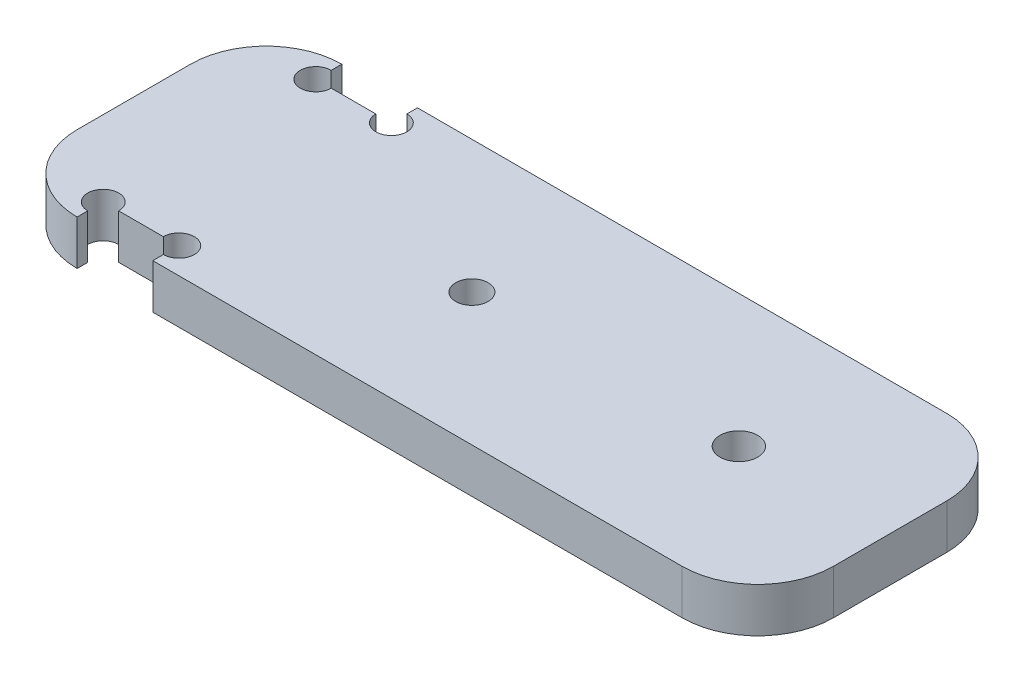
ISO-10303-21;
HEADER;
FILE_DESCRIPTION(('STEP AP214'),'2;1');
FILE_NAME('part.step','',(''),(''),'','','');
FILE_SCHEMA(('AUTOMOTIVE_DESIGN { 1 0 10303 214 1 1 1 1 }'));
ENDSEC;
DATA;
#1=APPLICATION_CONTEXT('core data for automotive mechanical design processes');
#2=APPLICATION_PROTOCOL_DEFINITION('international standard','automotive_design',2000,#1);
#3=PRODUCT_CONTEXT('',#1,'mechanical');
#4=PRODUCT('Part','Part','',(#3));
#5=PRODUCT_RELATED_PRODUCT_CATEGORY('part','',(#4));
#6=PRODUCT_DEFINITION_FORMATION('','',#4);
#7=PRODUCT_DEFINITION_CONTEXT('part definition',#1,'design');
#8=PRODUCT_DEFINITION('design','',#6,#7);
#9=PRODUCT_DEFINITION_SHAPE('','',#8);
#10=(LENGTH_UNIT() NAMED_UNIT(*) SI_UNIT(.MILLI.,.METRE.));
#11=(NAMED_UNIT(*) PLANE_ANGLE_UNIT() SI_UNIT($,.RADIAN.));
#12=(NAMED_UNIT(*) SI_UNIT($,.STERADIAN.) SOLID_ANGLE_UNIT());
#13=UNCERTAINTY_MEASURE_WITH_UNIT(LENGTH_MEASURE(1.E-05),#10,'distance_accuracy_value','');
#14=(GEOMETRIC_REPRESENTATION_CONTEXT(3) GLOBAL_UNCERTAINTY_ASSIGNED_CONTEXT((#13)) GLOBAL_UNIT_ASSIGNED_CONTEXT((#10,
#11,#12)) REPRESENTATION_CONTEXT('',''));
#15=CARTESIAN_POINT('',(0.,0.,0.));
#16=DIRECTION('',(0.,0.,1.));
#17=DIRECTION('',(1.,0.,0.));
#18=AXIS2_PLACEMENT_3D('',#15,#16,#17);
#19=CARTESIAN_POINT('',(49.9999999999985,5.89999999999947,17.4999999999993));
#20=DIRECTION('',(-0.999999999999989,0.,0.));
#21=DIRECTION('',(0.,0.,0.999999999999989));
#22=AXIS2_PLACEMENT_3D('',#19,#20,#21);
#23=PLANE('',#22);
#24=DIRECTION('',(0.,0.,-0.999999999999989));
#25=VECTOR('',#24,1.);
#26=CARTESIAN_POINT('',(49.999999999999,-1.2490009027033E-13,17.4999999999993));
#27=LINE('',#26,#25);
#28=CARTESIAN_POINT('',(49.9999999999995,0.,7.49999999999998));
#29=VERTEX_POINT('',#28);
#30=CARTESIAN_POINT('',(49.9999999999988,-1.2490009027033E-13,-7.50000000000019));
#31=VERTEX_POINT('',#30);
#32=EDGE_CURVE('E230',#29,#31,#27,.T.);
#33=ORIENTED_EDGE('',*,*,#32,.T.);
#34=DIRECTION('',(0.,-0.999999999999966,0.));
#35=VECTOR('',#34,1.);
#36=CARTESIAN_POINT('',(49.9999999999986,5.89999999999947,-7.50000000000055));
#37=LINE('',#36,#35);
#38=CARTESIAN_POINT('',(49.9999999999986,5.89999999999947,-7.50000000000055));
#39=VERTEX_POINT('',#38);
#40=EDGE_CURVE('E272',#31,#39,#37,.F.);
#41=ORIENTED_EDGE('',*,*,#40,.T.);
#42=DIRECTION('',(0.,0.,-0.999999999999989));
#43=VECTOR('',#42,1.);
#44=CARTESIAN_POINT('',(49.9999999999985,5.89999999999947,17.4999999999993));
#45=LINE('',#44,#43);
#46=CARTESIAN_POINT('',(49.9999999999988,5.89999999999947,7.50000000000006));
#47=VERTEX_POINT('',#46);
#48=EDGE_CURVE('E218',#47,#39,#45,.T.);
#49=ORIENTED_EDGE('',*,*,#48,.F.);
#50=DIRECTION('',(0.,-0.999999999999966,0.));
#51=VECTOR('',#50,1.);
#52=CARTESIAN_POINT('',(49.9999999999988,5.89999999999947,7.50000000000006));
#53=LINE('',#52,#51);
#54=EDGE_CURVE('E269',#47,#29,#53,.T.);
#55=ORIENTED_EDGE('',*,*,#54,.T.);
#56=EDGE_LOOP('',(#33,#41,#49,#55));
#57=FACE_BOUND('',#56,.T.);
#58=ADVANCED_FACE('F39',(#57),#23,.F.);
#59=CARTESIAN_POINT('',(-49.9999999999997,5.89999999999947,-17.5000000000021));
#60=DIRECTION('',(0.,0.,0.999999999999989));
#61=DIRECTION('',(0.999999999999989,0.,0.));
#62=AXIS2_PLACEMENT_3D('',#59,#60,#61);
#63=PLANE('',#62);
#64=DIRECTION('',(-0.999999999999989,0.,0.));
#65=VECTOR('',#64,1.);
#66=CARTESIAN_POINT('',(-50.,-1.06858966120171E-12,-17.5000000000021));
#67=LINE('',#66,#65);
#68=CARTESIAN_POINT('',(39.9999999999986,0.,-17.5000000000015));
#69=VERTEX_POINT('',#68);
#70=CARTESIAN_POINT('',(-30.,0.,-17.5));
#71=VERTEX_POINT('',#70);
#72=EDGE_CURVE('E233',#69,#71,#67,.T.);
#73=ORIENTED_EDGE('',*,*,#72,.T.);
#74=DIRECTION('',(0.,0.999999999999966,0.));
#75=VECTOR('',#74,1.);
#76=CARTESIAN_POINT('',(-30.,-4.10000000000001,-17.4999999999999));
#77=LINE('',#76,#75);
#78=CARTESIAN_POINT('',(-29.999999999999,5.89999999999947,-17.5000000000008));
#79=VERTEX_POINT('',#78);
#80=EDGE_CURVE('E187',#71,#79,#77,.T.);
#81=ORIENTED_EDGE('',*,*,#80,.T.);
#82=DIRECTION('',(-0.999999999999989,0.,0.));
#83=VECTOR('',#82,1.);
#84=CARTESIAN_POINT('',(-49.9999999999997,5.89999999999947,-17.5000000000021));
#85=LINE('',#84,#83);
#86=CARTESIAN_POINT('',(39.9999999999985,5.89999999999947,-17.5000000000014));
#87=VERTEX_POINT('',#86);
#88=EDGE_CURVE('E221',#87,#79,#85,.T.);
#89=ORIENTED_EDGE('',*,*,#88,.F.);
#90=DIRECTION('',(0.,-0.999999999999966,0.));
#91=VECTOR('',#90,1.);
#92=CARTESIAN_POINT('',(39.9999999999985,5.89999999999947,-17.5000000000014));
#93=LINE('',#92,#91);
#94=EDGE_CURVE('E255',#87,#69,#93,.T.);
#95=ORIENTED_EDGE('',*,*,#94,.T.);
#96=EDGE_LOOP('',(#73,#81,#89,#95));
#97=FACE_BOUND('',#96,.T.);
#98=ADVANCED_FACE('F375',(#97),#63,.F.);
#99=CARTESIAN_POINT('',(-49.9999999999989,5.89999999999947,17.5));
#100=DIRECTION('',(0.999999999999989,0.,0.));
#101=DIRECTION('',(0.,0.,-0.999999999999989));
#102=AXIS2_PLACEMENT_3D('',#99,#100,#101);
#103=PLANE('',#102);
#104=DIRECTION('',(0.,0.,0.999999999999989));
#105=VECTOR('',#104,1.);
#106=CARTESIAN_POINT('',(-49.9999999999989,5.89999999999947,17.5));
#107=LINE('',#106,#105);
#108=CARTESIAN_POINT('',(-49.9999999999999,5.89999999999893,-7.49999999999991));
#109=VERTEX_POINT('',#108);
#110=CARTESIAN_POINT('',(-49.9999999999989,5.89999999999947,7.49999999999967));
#111=VERTEX_POINT('',#110);
#112=EDGE_CURVE('E224',#109,#111,#107,.T.);
#113=ORIENTED_EDGE('',*,*,#112,.F.);
#114=DIRECTION('',(0.,-0.999999999999966,0.));
#115=VECTOR('',#114,1.);
#116=CARTESIAN_POINT('',(-49.9999999999999,5.89999999999893,-7.49999999999991));
#117=LINE('',#116,#115);
#118=CARTESIAN_POINT('',(-49.9999999999999,-1.06858966120171E-12,-7.49999999999977));
#119=VERTEX_POINT('',#118);
#120=EDGE_CURVE('E242',#109,#119,#117,.T.);
#121=ORIENTED_EDGE('',*,*,#120,.T.);
#122=DIRECTION('',(0.,0.,0.999999999999989));
#123=VECTOR('',#122,1.);
#124=CARTESIAN_POINT('',(-50.,-1.06858966120171E-12,17.5));
#125=LINE('',#124,#123);
#126=CARTESIAN_POINT('',(-50.,0.,7.50000000000001));
#127=VERTEX_POINT('',#126);
#128=EDGE_CURVE('E235',#119,#127,#125,.T.);
#129=ORIENTED_EDGE('',*,*,#128,.T.);
#130=DIRECTION('',(0.,-0.999999999999966,0.));
#131=VECTOR('',#130,1.);
#132=CARTESIAN_POINT('',(-49.9999999999989,5.89999999999947,7.49999999999967));
#133=LINE('',#132,#131);
#134=EDGE_CURVE('E229',#127,#111,#133,.F.);
#135=ORIENTED_EDGE('',*,*,#134,.T.);
#136=EDGE_LOOP('',(#113,#121,#129,#135));
#137=FACE_BOUND('',#136,.T.);
#138=ADVANCED_FACE('F335',(#137),#103,.F.);
#139=CARTESIAN_POINT('',(-49.9999999999989,5.89999999999947,17.5));
#140=DIRECTION('',(0.,0.,-0.999999999999989));
#141=DIRECTION('',(-0.999999999999989,0.,0.));
#142=AXIS2_PLACEMENT_3D('',#139,#140,#141);
#143=PLANE('',#142);
#144=DIRECTION('',(0.999999999999989,0.,0.));
#145=VECTOR('',#144,1.);
#146=CARTESIAN_POINT('',(-49.9999999999989,5.89999999999947,17.5));
#147=LINE('',#146,#145);
#148=CARTESIAN_POINT('',(-29.9999999999989,5.89999999999945,17.4999999999996));
#149=VERTEX_POINT('',#148);
#150=CARTESIAN_POINT('',(39.9999999999986,5.89999999999947,17.4999999999991));
#151=VERTEX_POINT('',#150);
#152=EDGE_CURVE('E227',#149,#151,#147,.T.);
#153=ORIENTED_EDGE('',*,*,#152,.F.);
#154=DIRECTION('',(0.,0.999999999999966,0.));
#155=VECTOR('',#154,1.);
#156=CARTESIAN_POINT('',(-30.,-4.10000000000001,17.5));
#157=LINE('',#156,#155);
#158=CARTESIAN_POINT('',(-30.,-1.06858966120171E-12,17.5));
#159=VERTEX_POINT('',#158);
#160=EDGE_CURVE('E201',#159,#149,#157,.T.);
#161=ORIENTED_EDGE('',*,*,#160,.F.);
#162=DIRECTION('',(0.999999999999989,0.,0.));
#163=VECTOR('',#162,1.);
#164=CARTESIAN_POINT('',(-50.,-1.06858966120171E-12,17.5));
#165=LINE('',#164,#163);
#166=CARTESIAN_POINT('',(39.999999999999,0.,17.4999999999989));
#167=VERTEX_POINT('',#166);
#168=EDGE_CURVE('E222',#159,#167,#165,.T.);
#169=ORIENTED_EDGE('',*,*,#168,.T.);
#170=DIRECTION('',(0.,-0.999999999999966,0.));
#171=VECTOR('',#170,1.);
#172=CARTESIAN_POINT('',(39.9999999999986,5.89999999999947,17.4999999999991));
#173=LINE('',#172,#171);
#174=EDGE_CURVE('E276',#167,#151,#173,.F.);
#175=ORIENTED_EDGE('',*,*,#174,.T.);
#176=EDGE_LOOP('',(#153,#161,#169,#175));
#177=FACE_BOUND('',#176,.T.);
#178=ADVANCED_FACE('F361',(#177),#143,.F.);
#179=CARTESIAN_POINT('',(-5.34294830600857E-13,5.89999999999947,0.));
#180=DIRECTION('',(0.,-0.999999999999966,0.));
#181=DIRECTION('',(0.,0.,-0.999999999999989));
#182=AXIS2_PLACEMENT_3D('',#179,#180,#181);
#183=PLANE('',#182);
#184=CARTESIAN_POINT('',(-5.29999999999999,5.89999999999894,0.));
#185=DIRECTION('',(0.,0.999999999999966,0.));
#186=DIRECTION('',(0.,0.,0.999999999999989));
#187=AXIS2_PLACEMENT_3D('',#184,#185,#186);
#188=CIRCLE('',#187,2.15);
#189=CARTESIAN_POINT('',(-5.29999999999999,5.89999999999894,2.14999999999998));
#190=VERTEX_POINT('',#189);
#191=EDGE_CURVE('E204',#190,#190,#188,.T.);
#192=ORIENTED_EDGE('',*,*,#191,.F.);
#193=EDGE_LOOP('',(#192));
#194=FACE_BOUND('',#193,.T.);
#195=CARTESIAN_POINT('',(29.9999999999993,5.8999999999994,-4.02455846426619E-13));
#196=DIRECTION('',(0.,0.999999999999966,0.));
#197=DIRECTION('',(0.,0.,0.999999999999989));
#198=AXIS2_PLACEMENT_3D('',#195,#196,#197);
#199=CIRCLE('',#198,2.50000000000001);
#200=CARTESIAN_POINT('',(29.9999999999993,5.8999999999994,2.49999999999958));
#201=VERTEX_POINT('',#200);
#202=EDGE_CURVE('E214',#201,#201,#199,.T.);
#203=ORIENTED_EDGE('',*,*,#202,.F.);
#204=EDGE_LOOP('',(#203));
#205=FACE_BOUND('',#204,.T.);
#206=DIRECTION('',(0.,0.,0.999999999999987));
#207=VECTOR('',#206,1.);
#208=CARTESIAN_POINT('',(-39.9999999999997,5.89999999999947,17.4999999999989));
#209=LINE('',#208,#207);
#210=CARTESIAN_POINT('',(-39.9999999999999,5.89999999999947,16.099999999999));
#211=VERTEX_POINT('',#210);
#212=CARTESIAN_POINT('',(-39.9999999999997,5.89999999999947,17.4999999999989));
#213=VERTEX_POINT('',#212);
#214=EDGE_CURVE('E210',#211,#213,#209,.T.);
#215=ORIENTED_EDGE('',*,*,#214,.F.);
#216=CARTESIAN_POINT('',(-39.9999999999994,5.89999999999947,14.0499999999991));
#217=DIRECTION('',(0.,0.999999999999966,0.));
#218=DIRECTION('',(0.,0.,0.999999999999989));
#219=AXIS2_PLACEMENT_3D('',#216,#217,#218);
#220=CIRCLE('',#219,2.05);
#221=CARTESIAN_POINT('',(-37.95,5.89999999999947,14.05));
#222=VERTEX_POINT('',#221);
#223=EDGE_CURVE('E302',#222,#211,#220,.T.);
#224=ORIENTED_EDGE('',*,*,#223,.F.);
#225=DIRECTION('',(-0.999999999999989,0.,0.));
#226=VECTOR('',#225,1.);
#227=CARTESIAN_POINT('',(-39.9999999999994,5.89999999999947,14.0499999999991));
#228=LINE('',#227,#226);
#229=CARTESIAN_POINT('',(-32.05,5.89999999999893,14.0499999999989));
#230=VERTEX_POINT('',#229);
#231=EDGE_CURVE('E203',#230,#222,#228,.T.);
#232=ORIENTED_EDGE('',*,*,#231,.F.);
#233=CARTESIAN_POINT('',(-30.,5.89999999999893,14.05));
#234=DIRECTION('',(0.,0.999999999999966,0.));
#235=DIRECTION('',(0.,0.,0.999999999999989));
#236=AXIS2_PLACEMENT_3D('',#233,#234,#235);
#237=CIRCLE('',#236,2.05);
#238=CARTESIAN_POINT('',(-29.9999999999989,5.89999999999893,16.0999999999997));
#239=VERTEX_POINT('',#238);
#240=EDGE_CURVE('E295',#239,#230,#237,.T.);
#241=ORIENTED_EDGE('',*,*,#240,.F.);
#242=DIRECTION('',(0.,0.,-0.999999999999989));
#243=VECTOR('',#242,1.);
#244=CARTESIAN_POINT('',(-29.9999999999989,5.89999999999945,17.4999999999996));
#245=LINE('',#244,#243);
#246=EDGE_CURVE('E207',#149,#239,#245,.T.);
#247=ORIENTED_EDGE('',*,*,#246,.F.);
#248=ORIENTED_EDGE('',*,*,#152,.T.);
#249=CARTESIAN_POINT('',(39.9999999999986,5.89999999999945,7.49999999999977));
#250=DIRECTION('',(0.,-0.999999999999966,0.));
#251=DIRECTION('',(0.,0.,-0.999999999999989));
#252=AXIS2_PLACEMENT_3D('',#249,#250,#251);
#253=CIRCLE('',#252,10.);
#254=EDGE_CURVE('E263',#151,#47,#253,.F.);
#255=ORIENTED_EDGE('',*,*,#254,.T.);
#256=ORIENTED_EDGE('',*,*,#48,.T.);
#257=CARTESIAN_POINT('',(39.9999999999986,5.89999999999893,-7.50000000000094));
#258=DIRECTION('',(0.,-0.999999999999966,0.));
#259=DIRECTION('',(0.,0.,-0.999999999999989));
#260=AXIS2_PLACEMENT_3D('',#257,#258,#259);
#261=CIRCLE('',#260,10.);
#262=EDGE_CURVE('E265',#39,#87,#261,.F.);
#263=ORIENTED_EDGE('',*,*,#262,.T.);
#264=ORIENTED_EDGE('',*,*,#88,.T.);
#265=DIRECTION('',(0.,0.,-0.999999999999989));
#266=VECTOR('',#265,1.);
#267=CARTESIAN_POINT('',(-29.999999999999,5.89999999999947,-17.5000000000008));
#268=LINE('',#267,#266);
#269=CARTESIAN_POINT('',(-29.9999999999993,5.89999999999947,-16.0999999999997));
#270=VERTEX_POINT('',#269);
#271=EDGE_CURVE('E188',#270,#79,#268,.T.);
#272=ORIENTED_EDGE('',*,*,#271,.F.);
#273=CARTESIAN_POINT('',(-29.9999999999989,5.89999999999947,-14.05));
#274=DIRECTION('',(0.,0.999999999999966,0.));
#275=DIRECTION('',(0.,0.,0.999999999999989));
#276=AXIS2_PLACEMENT_3D('',#273,#274,#275);
#277=CIRCLE('',#276,2.05);
#278=CARTESIAN_POINT('',(-32.0499999999993,5.89999999999947,-14.0500000000011));
#279=VERTEX_POINT('',#278);
#280=EDGE_CURVE('E169',#279,#270,#277,.T.);
#281=ORIENTED_EDGE('',*,*,#280,.F.);
#282=DIRECTION('',(0.999999999999989,0.,0.));
#283=VECTOR('',#282,1.);
#284=CARTESIAN_POINT('',(-39.9999999999986,5.89999999999947,-14.0500000000003));
#285=LINE('',#284,#283);
#286=CARTESIAN_POINT('',(-37.9499999999999,5.89999999999946,-14.05));
#287=VERTEX_POINT('',#286);
#288=EDGE_CURVE('E197',#287,#279,#285,.T.);
#289=ORIENTED_EDGE('',*,*,#288,.F.);
#290=CARTESIAN_POINT('',(-39.9999999999986,5.89999999999947,-14.0500000000003));
#291=DIRECTION('',(0.,0.999999999999966,0.));
#292=DIRECTION('',(0.,0.,0.999999999999989));
#293=AXIS2_PLACEMENT_3D('',#290,#291,#292);
#294=CIRCLE('',#293,2.04999999999999);
#295=CARTESIAN_POINT('',(-39.9999999999999,5.89999999999946,-16.1));
#296=VERTEX_POINT('',#295);
#297=EDGE_CURVE('E308',#296,#287,#294,.T.);
#298=ORIENTED_EDGE('',*,*,#297,.F.);
#299=DIRECTION('',(0.,0.,0.999999999999989));
#300=VECTOR('',#299,1.);
#301=CARTESIAN_POINT('',(-39.9999999999999,5.89999999999945,-17.500000000002));
#302=LINE('',#301,#300);
#303=CARTESIAN_POINT('',(-39.9999999999999,5.89999999999945,-17.500000000002));
#304=VERTEX_POINT('',#303);
#305=EDGE_CURVE('E211',#304,#296,#302,.T.);
#306=ORIENTED_EDGE('',*,*,#305,.F.);
#307=CARTESIAN_POINT('',(-39.9999999999982,5.89999999999947,-7.50000000000099));
#308=DIRECTION('',(0.,-0.999999999999966,0.));
#309=DIRECTION('',(0.,0.,-0.999999999999989));
#310=AXIS2_PLACEMENT_3D('',#307,#308,#309);
#311=CIRCLE('',#310,10.);
#312=EDGE_CURVE('E267',#304,#109,#311,.F.);
#313=ORIENTED_EDGE('',*,*,#312,.T.);
#314=ORIENTED_EDGE('',*,*,#112,.T.);
#315=CARTESIAN_POINT('',(-40.,5.89999999999947,7.50000000000001));
#316=DIRECTION('',(0.,-0.999999999999966,0.));
#317=DIRECTION('',(0.,0.,-0.999999999999989));
#318=AXIS2_PLACEMENT_3D('',#315,#316,#317);
#319=CIRCLE('',#318,10.);
#320=EDGE_CURVE('E260',#111,#213,#319,.F.);
#321=ORIENTED_EDGE('',*,*,#320,.T.);
#322=EDGE_LOOP('',(#215,#224,#232,#241,#247,#248,#255,#256,#263,#264,#272,#281,#289,#298,#306,
#313,#314,#321));
#323=FACE_BOUND('',#322,.T.);
#324=ADVANCED_FACE('F328',(#194,#205,#323),#183,.F.);
#325=CARTESIAN_POINT('',(0.,0.,0.));
#326=DIRECTION('',(0.,-0.999999999999966,0.));
#327=DIRECTION('',(0.,0.,-0.999999999999989));
#328=AXIS2_PLACEMENT_3D('',#325,#326,#327);
#329=PLANE('',#328);
#330=CARTESIAN_POINT('',(-39.9999999999999,0.,14.0499999999989));
#331=DIRECTION('',(0.,-0.999999999999966,0.));
#332=DIRECTION('',(0.,0.,-0.999999999999989));
#333=AXIS2_PLACEMENT_3D('',#330,#331,#332);
#334=CIRCLE('',#333,2.05);
#335=CARTESIAN_POINT('',(-37.95,-1.17961196366423E-12,14.05));
#336=VERTEX_POINT('',#335);
#337=CARTESIAN_POINT('',(-40.,-1.17961196366423E-12,16.099999999999));
#338=VERTEX_POINT('',#337);
#339=EDGE_CURVE('E54',#336,#338,#334,.F.);
#340=ORIENTED_EDGE('',*,*,#339,.T.);
#341=DIRECTION('',(0.,0.,-0.999999999999987));
#342=VECTOR('',#341,1.);
#343=CARTESIAN_POINT('',(-39.9999999999999,-1.06858966120171E-12,3.33066907387547E-13));
#344=LINE('',#343,#342);
#345=CARTESIAN_POINT('',(-40.,-1.06858966120171E-12,17.4999999999989));
#346=VERTEX_POINT('',#345);
#347=EDGE_CURVE('E192',#346,#338,#344,.T.);
#348=ORIENTED_EDGE('',*,*,#347,.F.);
#349=CARTESIAN_POINT('',(-40.,-1.06858966120171E-12,7.50000000000001));
#350=DIRECTION('',(0.,-0.999999999999966,0.));
#351=DIRECTION('',(0.,0.,-0.999999999999989));
#352=AXIS2_PLACEMENT_3D('',#349,#350,#351);
#353=CIRCLE('',#352,10.);
#354=EDGE_CURVE('E245',#346,#127,#353,.T.);
#355=ORIENTED_EDGE('',*,*,#354,.T.);
#356=ORIENTED_EDGE('',*,*,#128,.F.);
#357=CARTESIAN_POINT('',(-39.9999999999998,0.,-7.5000000000021));
#358=DIRECTION('',(0.,-0.999999999999966,0.));
#359=DIRECTION('',(0.,0.,-0.999999999999989));
#360=AXIS2_PLACEMENT_3D('',#357,#358,#359);
#361=CIRCLE('',#360,10.);
#362=CARTESIAN_POINT('',(-40.,-1.06858966120171E-12,-17.5000000000021));
#363=VERTEX_POINT('',#362);
#364=EDGE_CURVE('E252',#119,#363,#361,.T.);
#365=ORIENTED_EDGE('',*,*,#364,.T.);
#366=DIRECTION('',(0.,0.,-0.999999999999989));
#367=VECTOR('',#366,1.);
#368=CARTESIAN_POINT('',(-40.,-1.06858966120171E-12,0.));
#369=LINE('',#368,#367);
#370=CARTESIAN_POINT('',(-39.9999999999999,-1.17961196366423E-12,-16.0999999999999));
#371=VERTEX_POINT('',#370);
#372=EDGE_CURVE('E195',#371,#363,#369,.T.);
#373=ORIENTED_EDGE('',*,*,#372,.F.);
#374=CARTESIAN_POINT('',(-40.,-1.06858966120171E-12,-14.05));
#375=DIRECTION('',(0.,-0.999999999999966,0.));
#376=DIRECTION('',(0.,0.,-0.999999999999989));
#377=AXIS2_PLACEMENT_3D('',#374,#375,#376);
#378=CIRCLE('',#377,2.04999999999999);
#379=CARTESIAN_POINT('',(-37.9499999999999,-1.17961196366423E-12,-14.0499999999997));
#380=VERTEX_POINT('',#379);
#381=EDGE_CURVE('E310',#371,#380,#378,.F.);
#382=ORIENTED_EDGE('',*,*,#381,.T.);
#383=DIRECTION('',(-0.999999999999989,0.,0.));
#384=VECTOR('',#383,1.);
#385=CARTESIAN_POINT('',(3.60822483003176E-13,0.,-14.050000000001));
#386=LINE('',#385,#384);
#387=CARTESIAN_POINT('',(-32.05,0.,-14.050000000002));
#388=VERTEX_POINT('',#387);
#389=EDGE_CURVE('E47',#388,#380,#386,.T.);
#390=ORIENTED_EDGE('',*,*,#389,.F.);
#391=CARTESIAN_POINT('',(-29.9999999999999,-1.06858966120171E-12,-14.0499999999998));
#392=DIRECTION('',(0.,-0.999999999999966,0.));
#393=DIRECTION('',(0.,0.,-0.999999999999989));
#394=AXIS2_PLACEMENT_3D('',#391,#392,#393);
#395=CIRCLE('',#394,2.05);
#396=CARTESIAN_POINT('',(-30.,0.,-16.1));
#397=VERTEX_POINT('',#396);
#398=EDGE_CURVE('E166',#388,#397,#395,.F.);
#399=ORIENTED_EDGE('',*,*,#398,.T.);
#400=DIRECTION('',(0.,0.,0.999999999999989));
#401=VECTOR('',#400,1.);
#402=CARTESIAN_POINT('',(-29.9999999999999,-1.2490009027033E-13,1.20736753927986E-12));
#403=LINE('',#402,#401);
#404=EDGE_CURVE('E11',#71,#397,#403,.T.);
#405=ORIENTED_EDGE('',*,*,#404,.F.);
#406=ORIENTED_EDGE('',*,*,#72,.F.);
#407=CARTESIAN_POINT('',(39.9999999999987,0.,-7.50000000000124));
#408=DIRECTION('',(0.,-0.999999999999966,0.));
#409=DIRECTION('',(0.,0.,-0.999999999999989));
#410=AXIS2_PLACEMENT_3D('',#407,#408,#409);
#411=CIRCLE('',#410,10.);
#412=EDGE_CURVE('E250',#69,#31,#411,.T.);
#413=ORIENTED_EDGE('',*,*,#412,.T.);
#414=ORIENTED_EDGE('',*,*,#32,.F.);
#415=CARTESIAN_POINT('',(39.9999999999989,-1.06858966120171E-12,7.49999999999959));
#416=DIRECTION('',(0.,-0.999999999999966,0.));
#417=DIRECTION('',(0.,0.,-0.999999999999989));
#418=AXIS2_PLACEMENT_3D('',#415,#416,#417);
#419=CIRCLE('',#418,10.);
#420=EDGE_CURVE('E247',#29,#167,#419,.T.);
#421=ORIENTED_EDGE('',*,*,#420,.T.);
#422=ORIENTED_EDGE('',*,*,#168,.F.);
#423=DIRECTION('',(0.,0.,0.999999999999989));
#424=VECTOR('',#423,1.);
#425=CARTESIAN_POINT('',(-29.9999999999999,-1.2490009027033E-13,1.20736753927986E-12));
#426=LINE('',#425,#424);
#427=CARTESIAN_POINT('',(-30.,-1.06858966120171E-12,16.1));
#428=VERTEX_POINT('',#427);
#429=EDGE_CURVE('E279',#428,#159,#426,.T.);
#430=ORIENTED_EDGE('',*,*,#429,.F.);
#431=CARTESIAN_POINT('',(-30.,-1.2490009027033E-13,14.05));
#432=DIRECTION('',(0.,-0.999999999999966,0.));
#433=DIRECTION('',(0.,0.,-0.999999999999989));
#434=AXIS2_PLACEMENT_3D('',#431,#432,#433);
#435=CIRCLE('',#434,2.05);
#436=CARTESIAN_POINT('',(-32.0500000000002,-1.06858966120171E-12,14.049999999999));
#437=VERTEX_POINT('',#436);
#438=EDGE_CURVE('E62',#428,#437,#435,.F.);
#439=ORIENTED_EDGE('',*,*,#438,.T.);
#440=DIRECTION('',(0.999999999999989,0.,0.));
#441=VECTOR('',#440,1.);
#442=CARTESIAN_POINT('',(-1.94289029309402E-13,-1.06858966120171E-12,14.049999999999));
#443=LINE('',#442,#441);
#444=EDGE_CURVE('E281',#336,#437,#443,.T.);
#445=ORIENTED_EDGE('',*,*,#444,.F.);
#446=EDGE_LOOP('',(#340,#348,#355,#356,#365,#373,#382,#390,#399,#405,#406,#413,#414,#421,#422,
#430,#439,#445));
#447=FACE_BOUND('',#446,.T.);
#448=CARTESIAN_POINT('',(-5.29999999999946,0.,0.));
#449=DIRECTION('',(0.,-0.999999999999966,0.));
#450=DIRECTION('',(0.,0.,-0.999999999999989));
#451=AXIS2_PLACEMENT_3D('',#448,#449,#450);
#452=CIRCLE('',#451,2.15);
#453=CARTESIAN_POINT('',(-5.29999999999946,0.,-2.15000000000001));
#454=VERTEX_POINT('',#453);
#455=EDGE_CURVE('E312',#454,#454,#452,.F.);
#456=ORIENTED_EDGE('',*,*,#455,.T.);
#457=EDGE_LOOP('',(#456));
#458=FACE_BOUND('',#457,.T.);
#459=CARTESIAN_POINT('',(29.9999999999993,-1.06858966120171E-12,-1.94289029309402E-13));
#460=DIRECTION('',(0.,-0.999999999999966,0.));
#461=DIRECTION('',(0.,0.,-0.999999999999989));
#462=AXIS2_PLACEMENT_3D('',#459,#460,#461);
#463=CIRCLE('',#462,2.50000000000001);
#464=CARTESIAN_POINT('',(29.9999999999993,-1.06858966120123E-12,-2.50000000000017));
#465=VERTEX_POINT('',#464);
#466=EDGE_CURVE('E217',#465,#465,#463,.T.);
#467=ORIENTED_EDGE('',*,*,#466,.F.);
#468=EDGE_LOOP('',(#467));
#469=FACE_BOUND('',#468,.T.);
#470=ADVANCED_FACE('F177',(#447,#458,#469),#329,.T.);
#471=CARTESIAN_POINT('',(29.9999999999994,-4.10000000000002,0.));
#472=DIRECTION('',(0.,0.999999999999966,0.));
#473=DIRECTION('',(0.,0.,0.999999999999989));
#474=AXIS2_PLACEMENT_3D('',#471,#472,#473);
#475=CYLINDRICAL_SURFACE('',#474,2.50000000000001);
#476=ORIENTED_EDGE('',*,*,#466,.T.);
#477=EDGE_LOOP('',(#476));
#478=FACE_BOUND('',#477,.T.);
#479=ORIENTED_EDGE('',*,*,#202,.T.);
#480=EDGE_LOOP('',(#479));
#481=FACE_BOUND('',#480,.T.);
#482=ADVANCED_FACE('F388',(#478,#481),#475,.F.);
#483=CARTESIAN_POINT('',(-39.9999999999982,5.89999999999947,-7.50000000000099));
#484=DIRECTION('',(0.,-0.999999999999966,0.));
#485=DIRECTION('',(0.,0.,-0.999999999999989));
#486=AXIS2_PLACEMENT_3D('',#483,#484,#485);
#487=CYLINDRICAL_SURFACE('',#486,10.);
#488=ORIENTED_EDGE('',*,*,#312,.F.);
#489=DIRECTION('',(0.,-0.999999999999966,0.));
#490=VECTOR('',#489,1.);
#491=CARTESIAN_POINT('',(-39.9999999999999,5.89999999999945,-17.500000000002));
#492=LINE('',#491,#490);
#493=EDGE_CURVE('E258',#363,#304,#492,.F.);
#494=ORIENTED_EDGE('',*,*,#493,.F.);
#495=ORIENTED_EDGE('',*,*,#364,.F.);
#496=ORIENTED_EDGE('',*,*,#120,.F.);
#497=EDGE_LOOP('',(#488,#494,#495,#496));
#498=FACE_BOUND('',#497,.T.);
#499=ADVANCED_FACE('F332',(#498),#487,.T.);
#500=CARTESIAN_POINT('',(39.9999999999986,5.89999999999893,-7.50000000000094));
#501=DIRECTION('',(0.,-0.999999999999966,0.));
#502=DIRECTION('',(0.,0.,-0.999999999999989));
#503=AXIS2_PLACEMENT_3D('',#500,#501,#502);
#504=CYLINDRICAL_SURFACE('',#503,10.);
#505=ORIENTED_EDGE('',*,*,#262,.F.);
#506=ORIENTED_EDGE('',*,*,#40,.F.);
#507=ORIENTED_EDGE('',*,*,#412,.F.);
#508=ORIENTED_EDGE('',*,*,#94,.F.);
#509=EDGE_LOOP('',(#505,#506,#507,#508));
#510=FACE_BOUND('',#509,.T.);
#511=ADVANCED_FACE('F373',(#510),#504,.T.);
#512=CARTESIAN_POINT('',(39.9999999999986,5.89999999999945,7.49999999999977));
#513=DIRECTION('',(0.,-0.999999999999966,0.));
#514=DIRECTION('',(0.,0.,-0.999999999999989));
#515=AXIS2_PLACEMENT_3D('',#512,#513,#514);
#516=CYLINDRICAL_SURFACE('',#515,10.);
#517=ORIENTED_EDGE('',*,*,#254,.F.);
#518=ORIENTED_EDGE('',*,*,#174,.F.);
#519=ORIENTED_EDGE('',*,*,#420,.F.);
#520=ORIENTED_EDGE('',*,*,#54,.F.);
#521=EDGE_LOOP('',(#517,#518,#519,#520));
#522=FACE_BOUND('',#521,.T.);
#523=ADVANCED_FACE('F367',(#522),#516,.T.);
#524=CARTESIAN_POINT('',(-40.,5.89999999999947,7.50000000000001));
#525=DIRECTION('',(0.,-0.999999999999966,0.));
#526=DIRECTION('',(0.,0.,-0.999999999999989));
#527=AXIS2_PLACEMENT_3D('',#524,#525,#526);
#528=CYLINDRICAL_SURFACE('',#527,10.);
#529=ORIENTED_EDGE('',*,*,#320,.F.);
#530=ORIENTED_EDGE('',*,*,#134,.F.);
#531=ORIENTED_EDGE('',*,*,#354,.F.);
#532=DIRECTION('',(0.,-0.999999999999966,0.));
#533=VECTOR('',#532,1.);
#534=CARTESIAN_POINT('',(-39.9999999999997,5.89999999999947,17.4999999999989));
#535=LINE('',#534,#533);
#536=EDGE_CURVE('E274',#213,#346,#535,.T.);
#537=ORIENTED_EDGE('',*,*,#536,.F.);
#538=EDGE_LOOP('',(#529,#530,#531,#537));
#539=FACE_BOUND('',#538,.T.);
#540=ADVANCED_FACE('F41',(#539),#528,.T.);
#541=CARTESIAN_POINT('',(-40.,-4.10000000000106,17.4999999999989));
#542=DIRECTION('',(-0.999999999999987,0.,0.));
#543=DIRECTION('',(0.,0.,0.999999999999987));
#544=AXIS2_PLACEMENT_3D('',#541,#542,#543);
#545=PLANE('',#544);
#546=ORIENTED_EDGE('',*,*,#347,.T.);
#547=DIRECTION('',(0.,0.999999999999966,0.));
#548=VECTOR('',#547,1.);
#549=CARTESIAN_POINT('',(-40.,-0.00100000000118061,16.099999999999));
#550=LINE('',#549,#548);
#551=EDGE_CURVE('E304',#211,#338,#550,.F.);
#552=ORIENTED_EDGE('',*,*,#551,.F.);
#553=ORIENTED_EDGE('',*,*,#214,.T.);
#554=ORIENTED_EDGE('',*,*,#536,.T.);
#555=EDGE_LOOP('',(#546,#552,#553,#554));
#556=FACE_BOUND('',#555,.T.);
#557=ADVANCED_FACE('F346',(#556),#545,.F.);
#558=CARTESIAN_POINT('',(-40.,-4.10000000000001,14.0499999999989));
#559=DIRECTION('',(0.,0.,-0.999999999999989));
#560=DIRECTION('',(-0.999999999999989,0.,0.));
#561=AXIS2_PLACEMENT_3D('',#558,#559,#560);
#562=PLANE('',#561);
#563=ORIENTED_EDGE('',*,*,#231,.T.);
#564=DIRECTION('',(0.,0.999999999999966,0.));
#565=VECTOR('',#564,1.);
#566=CARTESIAN_POINT('',(-37.95,-0.00100000000118061,14.05));
#567=LINE('',#566,#565);
#568=EDGE_CURVE('E296',#336,#222,#567,.T.);
#569=ORIENTED_EDGE('',*,*,#568,.F.);
#570=ORIENTED_EDGE('',*,*,#444,.T.);
#571=DIRECTION('',(0.,0.999999999999966,0.));
#572=VECTOR('',#571,1.);
#573=CARTESIAN_POINT('',(-32.0500000000002,-0.00100000000106959,14.049999999999));
#574=LINE('',#573,#572);
#575=EDGE_CURVE('E298',#230,#437,#574,.F.);
#576=ORIENTED_EDGE('',*,*,#575,.F.);
#577=EDGE_LOOP('',(#563,#569,#570,#576));
#578=FACE_BOUND('',#577,.T.);
#579=ADVANCED_FACE('F352',(#578),#562,.F.);
#580=CARTESIAN_POINT('',(-30.,-4.10000000000001,17.5));
#581=DIRECTION('',(0.999999999999989,0.,0.));
#582=DIRECTION('',(0.,0.,-0.999999999999989));
#583=AXIS2_PLACEMENT_3D('',#580,#581,#582);
#584=PLANE('',#583);
#585=ORIENTED_EDGE('',*,*,#246,.T.);
#586=DIRECTION('',(0.,0.999999999999966,0.));
#587=VECTOR('',#586,1.);
#588=CARTESIAN_POINT('',(-30.,-0.00100000000106959,16.1));
#589=LINE('',#588,#587);
#590=EDGE_CURVE('E183',#428,#239,#589,.T.);
#591=ORIENTED_EDGE('',*,*,#590,.F.);
#592=ORIENTED_EDGE('',*,*,#429,.T.);
#593=ORIENTED_EDGE('',*,*,#160,.T.);
#594=EDGE_LOOP('',(#585,#591,#592,#593));
#595=FACE_BOUND('',#594,.T.);
#596=ADVANCED_FACE('F357',(#595),#584,.F.);
#597=CARTESIAN_POINT('',(-39.9999999999998,-4.10000000000001,-17.4999999999995));
#598=DIRECTION('',(-0.999999999999989,0.,0.));
#599=DIRECTION('',(0.,0.,0.999999999999989));
#600=AXIS2_PLACEMENT_3D('',#597,#598,#599);
#601=PLANE('',#600);
#602=ORIENTED_EDGE('',*,*,#305,.T.);
#603=DIRECTION('',(0.,0.999999999999966,0.));
#604=VECTOR('',#603,1.);
#605=CARTESIAN_POINT('',(-39.9999999999999,-0.00100000000116673,-16.0999999999999));
#606=LINE('',#605,#604);
#607=EDGE_CURVE('E290',#371,#296,#606,.T.);
#608=ORIENTED_EDGE('',*,*,#607,.F.);
#609=ORIENTED_EDGE('',*,*,#372,.T.);
#610=ORIENTED_EDGE('',*,*,#493,.T.);
#611=EDGE_LOOP('',(#602,#608,#609,#610));
#612=FACE_BOUND('',#611,.T.);
#613=ADVANCED_FACE('F321',(#612),#601,.F.);
#614=CARTESIAN_POINT('',(-30.,-4.10000000000001,-17.4999999999999));
#615=DIRECTION('',(0.999999999999989,0.,0.));
#616=DIRECTION('',(0.,0.,-0.999999999999989));
#617=AXIS2_PLACEMENT_3D('',#614,#615,#616);
#618=PLANE('',#617);
#619=ORIENTED_EDGE('',*,*,#404,.T.);
#620=DIRECTION('',(0.,0.999999999999966,0.));
#621=VECTOR('',#620,1.);
#622=CARTESIAN_POINT('',(-30.,-0.001000000000001,-16.1));
#623=LINE('',#622,#621);
#624=EDGE_CURVE('E163',#270,#397,#623,.F.);
#625=ORIENTED_EDGE('',*,*,#624,.F.);
#626=ORIENTED_EDGE('',*,*,#271,.T.);
#627=ORIENTED_EDGE('',*,*,#80,.F.);
#628=EDGE_LOOP('',(#619,#625,#626,#627));
#629=FACE_BOUND('',#628,.T.);
#630=ADVANCED_FACE('F185',(#629),#618,.F.);
#631=CARTESIAN_POINT('',(-39.9999999999999,-4.10000000000106,-14.0499999999999));
#632=DIRECTION('',(0.,0.,0.999999999999989));
#633=DIRECTION('',(0.999999999999989,0.,0.));
#634=AXIS2_PLACEMENT_3D('',#631,#632,#633);
#635=PLANE('',#634);
#636=ORIENTED_EDGE('',*,*,#288,.T.);
#637=DIRECTION('',(0.,0.999999999999966,0.));
#638=VECTOR('',#637,1.);
#639=CARTESIAN_POINT('',(-32.05,-0.001000000000001,-14.050000000002));
#640=LINE('',#639,#638);
#641=EDGE_CURVE('E172',#388,#279,#640,.T.);
#642=ORIENTED_EDGE('',*,*,#641,.F.);
#643=ORIENTED_EDGE('',*,*,#389,.T.);
#644=DIRECTION('',(0.,0.999999999999966,0.));
#645=VECTOR('',#644,1.);
#646=CARTESIAN_POINT('',(-37.9499999999999,-0.00100000000116673,-14.0499999999997));
#647=LINE('',#646,#645);
#648=EDGE_CURVE('E287',#287,#380,#647,.F.);
#649=ORIENTED_EDGE('',*,*,#648,.F.);
#650=EDGE_LOOP('',(#636,#642,#643,#649));
#651=FACE_BOUND('',#650,.T.);
#652=ADVANCED_FACE('F286',(#651),#635,.F.);
#653=CARTESIAN_POINT('',(-5.29999999999946,-0.001000000000001,0.));
#654=DIRECTION('',(0.,0.999999999999966,0.));
#655=DIRECTION('',(0.,0.,0.999999999999989));
#656=AXIS2_PLACEMENT_3D('',#653,#654,#655);
#657=CYLINDRICAL_SURFACE('',#656,2.15);
#658=ORIENTED_EDGE('',*,*,#455,.F.);
#659=EDGE_LOOP('',(#658));
#660=FACE_BOUND('',#659,.T.);
#661=ORIENTED_EDGE('',*,*,#191,.T.);
#662=EDGE_LOOP('',(#661));
#663=FACE_BOUND('',#662,.T.);
#664=ADVANCED_FACE('F493',(#660,#663),#657,.F.);
#665=CARTESIAN_POINT('',(-40.,-0.00100000000106959,-14.05));
#666=DIRECTION('',(0.,0.999999999999966,0.));
#667=DIRECTION('',(0.,0.,0.999999999999989));
#668=AXIS2_PLACEMENT_3D('',#665,#666,#667);
#669=CYLINDRICAL_SURFACE('',#668,2.04999999999999);
#670=ORIENTED_EDGE('',*,*,#607,.T.);
#671=ORIENTED_EDGE('',*,*,#297,.T.);
#672=ORIENTED_EDGE('',*,*,#648,.T.);
#673=ORIENTED_EDGE('',*,*,#381,.F.);
#674=EDGE_LOOP('',(#670,#671,#672,#673));
#675=FACE_BOUND('',#674,.T.);
#676=ADVANCED_FACE('F501',(#675),#669,.F.);
#677=CARTESIAN_POINT('',(-29.9999999999999,-0.00100000000106959,-14.0499999999998));
#678=DIRECTION('',(0.,0.999999999999966,0.));
#679=DIRECTION('',(0.,0.,0.999999999999989));
#680=AXIS2_PLACEMENT_3D('',#677,#678,#679);
#681=CYLINDRICAL_SURFACE('',#680,2.05);
#682=ORIENTED_EDGE('',*,*,#624,.T.);
#683=ORIENTED_EDGE('',*,*,#398,.F.);
#684=ORIENTED_EDGE('',*,*,#641,.T.);
#685=ORIENTED_EDGE('',*,*,#280,.T.);
#686=EDGE_LOOP('',(#682,#683,#684,#685));
#687=FACE_BOUND('',#686,.T.);
#688=ADVANCED_FACE('F165',(#687),#681,.F.);
#689=CARTESIAN_POINT('',(-30.,-0.0010000000001259,14.05));
#690=DIRECTION('',(0.,0.999999999999966,0.));
#691=DIRECTION('',(0.,0.,0.999999999999989));
#692=AXIS2_PLACEMENT_3D('',#689,#690,#691);
#693=CYLINDRICAL_SURFACE('',#692,2.05);
#694=ORIENTED_EDGE('',*,*,#575,.T.);
#695=ORIENTED_EDGE('',*,*,#438,.F.);
#696=ORIENTED_EDGE('',*,*,#590,.T.);
#697=ORIENTED_EDGE('',*,*,#240,.T.);
#698=EDGE_LOOP('',(#694,#695,#696,#697));
#699=FACE_BOUND('',#698,.T.);
#700=ADVANCED_FACE('F520',(#699),#693,.F.);
#701=CARTESIAN_POINT('',(-39.9999999999999,-0.001000000000001,14.0499999999989));
#702=DIRECTION('',(0.,0.999999999999966,0.));
#703=DIRECTION('',(0.,0.,0.999999999999989));
#704=AXIS2_PLACEMENT_3D('',#701,#702,#703);
#705=CYLINDRICAL_SURFACE('',#704,2.05);
#706=ORIENTED_EDGE('',*,*,#551,.T.);
#707=ORIENTED_EDGE('',*,*,#339,.F.);
#708=ORIENTED_EDGE('',*,*,#568,.T.);
#709=ORIENTED_EDGE('',*,*,#223,.T.);
#710=EDGE_LOOP('',(#706,#707,#708,#709));
#711=FACE_BOUND('',#710,.T.);
#712=ADVANCED_FACE('F347',(#711),#705,.F.);
#713=CLOSED_SHELL('',(#58,#98,#138,#178,#324,#470,#482,#499,#511,#523,#540,#557,#579,#596,#613,
#630,#652,#664,#676,#688,#700,#712));
#714=MANIFOLD_SOLID_BREP('B2',#713);
#715=ADVANCED_BREP_SHAPE_REPRESENTATION('',(#18,#714),#14);
#716=SHAPE_DEFINITION_REPRESENTATION(#9,#715);
ENDSEC;
END-ISO-10303-21;
